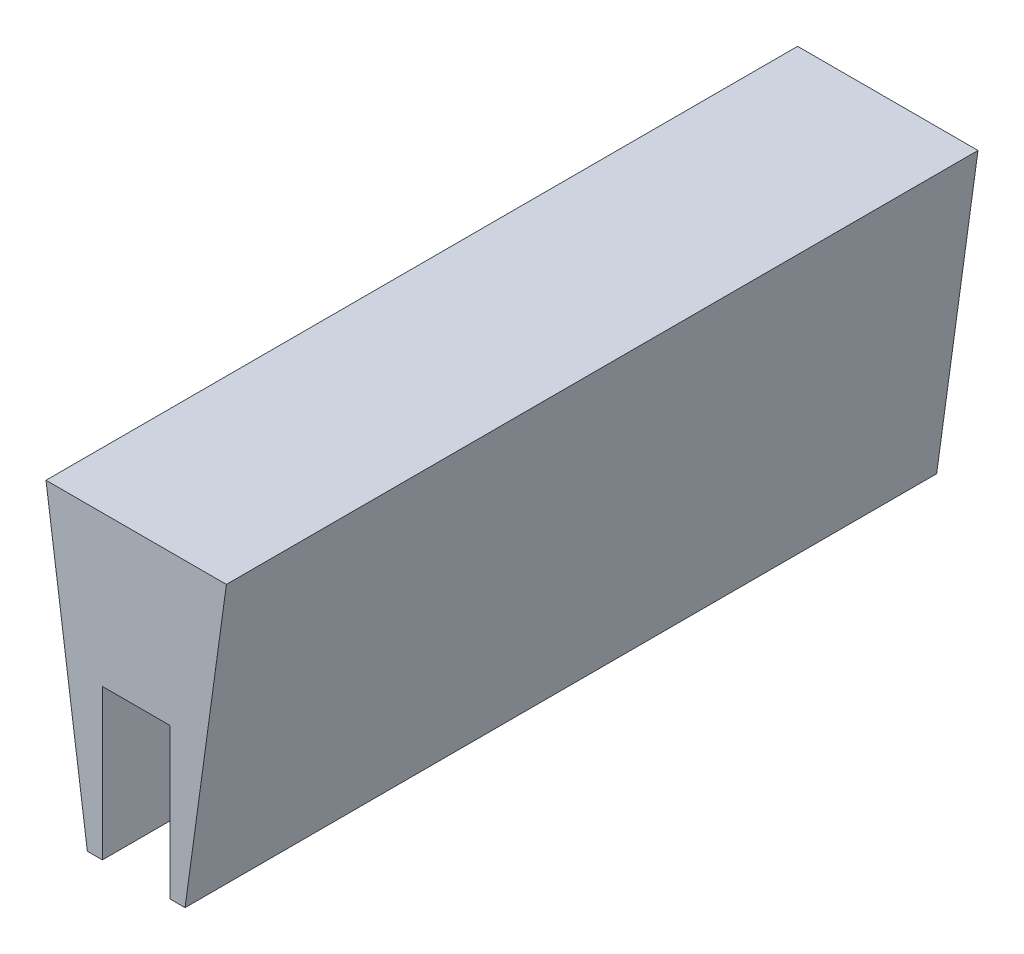
ISO-10303-21;
HEADER;
FILE_DESCRIPTION(('STEP AP214'),'2;1');
FILE_NAME('part.step','',(''),(''),'','','');
FILE_SCHEMA(('AUTOMOTIVE_DESIGN { 1 0 10303 214 1 1 1 1 }'));
ENDSEC;
DATA;
#1=APPLICATION_CONTEXT('core data for automotive mechanical design processes');
#2=APPLICATION_PROTOCOL_DEFINITION('international standard','automotive_design',2000,#1);
#3=PRODUCT_CONTEXT('',#1,'mechanical');
#4=PRODUCT('Part','Part','',(#3));
#5=PRODUCT_RELATED_PRODUCT_CATEGORY('part','',(#4));
#6=PRODUCT_DEFINITION_FORMATION('','',#4);
#7=PRODUCT_DEFINITION_CONTEXT('part definition',#1,'design');
#8=PRODUCT_DEFINITION('design','',#6,#7);
#9=PRODUCT_DEFINITION_SHAPE('','',#8);
#10=(LENGTH_UNIT() NAMED_UNIT(*) SI_UNIT(.MILLI.,.METRE.));
#11=(NAMED_UNIT(*) PLANE_ANGLE_UNIT() SI_UNIT($,.RADIAN.));
#12=(NAMED_UNIT(*) SI_UNIT($,.STERADIAN.) SOLID_ANGLE_UNIT());
#13=UNCERTAINTY_MEASURE_WITH_UNIT(LENGTH_MEASURE(1.E-05),#10,'distance_accuracy_value','');
#14=(GEOMETRIC_REPRESENTATION_CONTEXT(3) GLOBAL_UNCERTAINTY_ASSIGNED_CONTEXT((#13)) GLOBAL_UNIT_ASSIGNED_CONTEXT((#10,
#11,#12)) REPRESENTATION_CONTEXT('',''));
#15=CARTESIAN_POINT('',(0.,0.,0.));
#16=DIRECTION('',(0.,0.,1.));
#17=DIRECTION('',(1.,0.,0.));
#18=AXIS2_PLACEMENT_3D('',#15,#16,#17);
#19=CARTESIAN_POINT('',(6.,20.,50.));
#20=DIRECTION('',(-0.990678839845296,0.136218340478728,0.));
#21=DIRECTION('',(-0.136218340478728,-0.990678839845296,0.));
#22=AXIS2_PLACEMENT_3D('',#19,#20,#21);
#23=PLANE('',#22);
#24=DIRECTION('',(0.136218340478728,0.990678839845296,0.));
#25=VECTOR('',#24,1.);
#26=CARTESIAN_POINT('',(6.,20.,0.));
#27=LINE('',#26,#25);
#28=CARTESIAN_POINT('',(3.25,0.,0.));
#29=VERTEX_POINT('',#28);
#30=CARTESIAN_POINT('',(6.,20.,0.));
#31=VERTEX_POINT('',#30);
#32=EDGE_CURVE('E140',#29,#31,#27,.T.);
#33=ORIENTED_EDGE('',*,*,#32,.T.);
#34=DIRECTION('',(0.,0.,-1.));
#35=VECTOR('',#34,1.);
#36=CARTESIAN_POINT('',(6.,20.,50.));
#37=LINE('',#36,#35);
#38=CARTESIAN_POINT('',(6.,20.,50.));
#39=VERTEX_POINT('',#38);
#40=EDGE_CURVE('E11',#39,#31,#37,.T.);
#41=ORIENTED_EDGE('',*,*,#40,.F.);
#42=DIRECTION('',(0.136218340478728,0.990678839845296,0.));
#43=VECTOR('',#42,1.);
#44=CARTESIAN_POINT('',(6.,20.,50.));
#45=LINE('',#44,#43);
#46=CARTESIAN_POINT('',(3.25,0.,50.));
#47=VERTEX_POINT('',#46);
#48=EDGE_CURVE('E162',#47,#39,#45,.T.);
#49=ORIENTED_EDGE('',*,*,#48,.F.);
#50=DIRECTION('',(0.,0.,-1.));
#51=VECTOR('',#50,1.);
#52=CARTESIAN_POINT('',(3.25,0.,50.));
#53=LINE('',#52,#51);
#54=EDGE_CURVE('E136',#47,#29,#53,.T.);
#55=ORIENTED_EDGE('',*,*,#54,.T.);
#56=EDGE_LOOP('',(#33,#41,#49,#55));
#57=FACE_BOUND('',#56,.T.);
#58=ADVANCED_FACE('F39',(#57),#23,.F.);
#59=CARTESIAN_POINT('',(-6.,20.,50.));
#60=DIRECTION('',(0.,-1.,0.));
#61=DIRECTION('',(0.,0.,-1.));
#62=AXIS2_PLACEMENT_3D('',#59,#60,#61);
#63=PLANE('',#62);
#64=DIRECTION('',(-1.,0.,0.));
#65=VECTOR('',#64,1.);
#66=CARTESIAN_POINT('',(-6.,20.,0.));
#67=LINE('',#66,#65);
#68=CARTESIAN_POINT('',(-6.,20.,0.));
#69=VERTEX_POINT('',#68);
#70=EDGE_CURVE('E144',#31,#69,#67,.T.);
#71=ORIENTED_EDGE('',*,*,#70,.T.);
#72=DIRECTION('',(0.,0.,-1.));
#73=VECTOR('',#72,1.);
#74=CARTESIAN_POINT('',(-6.,20.,50.));
#75=LINE('',#74,#73);
#76=CARTESIAN_POINT('',(-6.,20.,50.));
#77=VERTEX_POINT('',#76);
#78=EDGE_CURVE('E48',#77,#69,#75,.T.);
#79=ORIENTED_EDGE('',*,*,#78,.F.);
#80=DIRECTION('',(-1.,0.,0.));
#81=VECTOR('',#80,1.);
#82=CARTESIAN_POINT('',(-6.,20.,50.));
#83=LINE('',#82,#81);
#84=EDGE_CURVE('E99',#39,#77,#83,.T.);
#85=ORIENTED_EDGE('',*,*,#84,.F.);
#86=ORIENTED_EDGE('',*,*,#40,.T.);
#87=EDGE_LOOP('',(#71,#79,#85,#86));
#88=FACE_BOUND('',#87,.T.);
#89=ADVANCED_FACE('F208',(#88),#63,.F.);
#90=CARTESIAN_POINT('',(-6.,20.,50.));
#91=DIRECTION('',(0.990678839845296,0.136218340478728,0.));
#92=DIRECTION('',(-0.136218340478728,0.990678839845296,0.));
#93=AXIS2_PLACEMENT_3D('',#90,#91,#92);
#94=PLANE('',#93);
#95=DIRECTION('',(0.136218340478728,-0.990678839845296,0.));
#96=VECTOR('',#95,1.);
#97=CARTESIAN_POINT('',(-6.,20.,0.));
#98=LINE('',#97,#96);
#99=CARTESIAN_POINT('',(-3.25,0.,0.));
#100=VERTEX_POINT('',#99);
#101=EDGE_CURVE('E147',#69,#100,#98,.T.);
#102=ORIENTED_EDGE('',*,*,#101,.T.);
#103=DIRECTION('',(0.,0.,-1.));
#104=VECTOR('',#103,1.);
#105=CARTESIAN_POINT('',(-3.25,0.,50.));
#106=LINE('',#105,#104);
#107=CARTESIAN_POINT('',(-3.25,0.,50.));
#108=VERTEX_POINT('',#107);
#109=EDGE_CURVE('E173',#108,#100,#106,.T.);
#110=ORIENTED_EDGE('',*,*,#109,.F.);
#111=DIRECTION('',(0.136218340478728,-0.990678839845296,0.));
#112=VECTOR('',#111,1.);
#113=CARTESIAN_POINT('',(-6.,20.,50.));
#114=LINE('',#113,#112);
#115=EDGE_CURVE('E183',#77,#108,#114,.T.);
#116=ORIENTED_EDGE('',*,*,#115,.F.);
#117=ORIENTED_EDGE('',*,*,#78,.T.);
#118=EDGE_LOOP('',(#102,#110,#116,#117));
#119=FACE_BOUND('',#118,.T.);
#120=ADVANCED_FACE('F181',(#119),#94,.F.);
#121=CARTESIAN_POINT('',(-3.25,0.,50.));
#122=DIRECTION('',(0.,1.,0.));
#123=DIRECTION('',(-1.,0.,0.));
#124=AXIS2_PLACEMENT_3D('',#121,#122,#123);
#125=PLANE('',#124);
#126=DIRECTION('',(1.,0.,0.));
#127=VECTOR('',#126,1.);
#128=CARTESIAN_POINT('',(-3.25,0.,0.));
#129=LINE('',#128,#127);
#130=CARTESIAN_POINT('',(-2.25,0.,0.));
#131=VERTEX_POINT('',#130);
#132=EDGE_CURVE('E150',#100,#131,#129,.T.);
#133=ORIENTED_EDGE('',*,*,#132,.T.);
#134=DIRECTION('',(0.,0.,-1.));
#135=VECTOR('',#134,1.);
#136=CARTESIAN_POINT('',(-2.25,0.,50.));
#137=LINE('',#136,#135);
#138=CARTESIAN_POINT('',(-2.25,0.,50.));
#139=VERTEX_POINT('',#138);
#140=EDGE_CURVE('E169',#139,#131,#137,.T.);
#141=ORIENTED_EDGE('',*,*,#140,.F.);
#142=DIRECTION('',(1.,0.,0.));
#143=VECTOR('',#142,1.);
#144=CARTESIAN_POINT('',(-3.25,0.,50.));
#145=LINE('',#144,#143);
#146=EDGE_CURVE('E196',#108,#139,#145,.T.);
#147=ORIENTED_EDGE('',*,*,#146,.F.);
#148=ORIENTED_EDGE('',*,*,#109,.T.);
#149=EDGE_LOOP('',(#133,#141,#147,#148));
#150=FACE_BOUND('',#149,.T.);
#151=ADVANCED_FACE('F191',(#150),#125,.F.);
#152=CARTESIAN_POINT('',(-2.25,0.,50.));
#153=DIRECTION('',(-1.,0.,0.));
#154=DIRECTION('',(0.,0.,1.));
#155=AXIS2_PLACEMENT_3D('',#152,#153,#154);
#156=PLANE('',#155);
#157=DIRECTION('',(0.,1.,0.));
#158=VECTOR('',#157,1.);
#159=CARTESIAN_POINT('',(-2.25,0.,0.));
#160=LINE('',#159,#158);
#161=CARTESIAN_POINT('',(-2.25,10.,0.));
#162=VERTEX_POINT('',#161);
#163=EDGE_CURVE('E153',#131,#162,#160,.T.);
#164=ORIENTED_EDGE('',*,*,#163,.T.);
#165=DIRECTION('',(0.,0.,-1.));
#166=VECTOR('',#165,1.);
#167=CARTESIAN_POINT('',(-2.25,10.,50.));
#168=LINE('',#167,#166);
#169=CARTESIAN_POINT('',(-2.25,10.,50.));
#170=VERTEX_POINT('',#169);
#171=EDGE_CURVE('E129',#170,#162,#168,.T.);
#172=ORIENTED_EDGE('',*,*,#171,.F.);
#173=DIRECTION('',(0.,1.,0.));
#174=VECTOR('',#173,1.);
#175=CARTESIAN_POINT('',(-2.25,0.,50.));
#176=LINE('',#175,#174);
#177=EDGE_CURVE('E118',#139,#170,#176,.T.);
#178=ORIENTED_EDGE('',*,*,#177,.F.);
#179=ORIENTED_EDGE('',*,*,#140,.T.);
#180=EDGE_LOOP('',(#164,#172,#178,#179));
#181=FACE_BOUND('',#180,.T.);
#182=ADVANCED_FACE('F194',(#181),#156,.F.);
#183=CARTESIAN_POINT('',(2.25,10.,50.));
#184=DIRECTION('',(0.,1.,0.));
#185=DIRECTION('',(0.,0.,1.));
#186=AXIS2_PLACEMENT_3D('',#183,#184,#185);
#187=PLANE('',#186);
#188=DIRECTION('',(1.,0.,0.));
#189=VECTOR('',#188,1.);
#190=CARTESIAN_POINT('',(2.25,10.,0.));
#191=LINE('',#190,#189);
#192=CARTESIAN_POINT('',(2.25,10.,0.));
#193=VERTEX_POINT('',#192);
#194=EDGE_CURVE('E127',#162,#193,#191,.T.);
#195=ORIENTED_EDGE('',*,*,#194,.T.);
#196=DIRECTION('',(0.,0.,-1.));
#197=VECTOR('',#196,1.);
#198=CARTESIAN_POINT('',(2.25,10.,50.));
#199=LINE('',#198,#197);
#200=CARTESIAN_POINT('',(2.25,10.,50.));
#201=VERTEX_POINT('',#200);
#202=EDGE_CURVE('E124',#201,#193,#199,.T.);
#203=ORIENTED_EDGE('',*,*,#202,.F.);
#204=DIRECTION('',(1.,0.,0.));
#205=VECTOR('',#204,1.);
#206=CARTESIAN_POINT('',(2.25,10.,50.));
#207=LINE('',#206,#205);
#208=EDGE_CURVE('E112',#170,#201,#207,.T.);
#209=ORIENTED_EDGE('',*,*,#208,.F.);
#210=ORIENTED_EDGE('',*,*,#171,.T.);
#211=EDGE_LOOP('',(#195,#203,#209,#210));
#212=FACE_BOUND('',#211,.T.);
#213=ADVANCED_FACE('F125',(#212),#187,.F.);
#214=CARTESIAN_POINT('',(2.25,0.,50.));
#215=DIRECTION('',(1.,0.,0.));
#216=DIRECTION('',(0.,0.,-1.));
#217=AXIS2_PLACEMENT_3D('',#214,#215,#216);
#218=PLANE('',#217);
#219=DIRECTION('',(0.,-1.,0.));
#220=VECTOR('',#219,1.);
#221=CARTESIAN_POINT('',(2.25,0.,0.));
#222=LINE('',#221,#220);
#223=CARTESIAN_POINT('',(2.25,0.,0.));
#224=VERTEX_POINT('',#223);
#225=EDGE_CURVE('E85',#193,#224,#222,.T.);
#226=ORIENTED_EDGE('',*,*,#225,.T.);
#227=DIRECTION('',(0.,0.,-1.));
#228=VECTOR('',#227,1.);
#229=CARTESIAN_POINT('',(2.25,0.,50.));
#230=LINE('',#229,#228);
#231=CARTESIAN_POINT('',(2.25,0.,50.));
#232=VERTEX_POINT('',#231);
#233=EDGE_CURVE('E130',#232,#224,#230,.T.);
#234=ORIENTED_EDGE('',*,*,#233,.F.);
#235=DIRECTION('',(0.,-1.,0.));
#236=VECTOR('',#235,1.);
#237=CARTESIAN_POINT('',(2.25,0.,50.));
#238=LINE('',#237,#236);
#239=EDGE_CURVE('E116',#201,#232,#238,.T.);
#240=ORIENTED_EDGE('',*,*,#239,.F.);
#241=ORIENTED_EDGE('',*,*,#202,.T.);
#242=EDGE_LOOP('',(#226,#234,#240,#241));
#243=FACE_BOUND('',#242,.T.);
#244=ADVANCED_FACE('F132',(#243),#218,.F.);
#245=CARTESIAN_POINT('',(3.25,0.,50.));
#246=DIRECTION('',(0.,1.,0.));
#247=DIRECTION('',(-1.,0.,0.));
#248=AXIS2_PLACEMENT_3D('',#245,#246,#247);
#249=PLANE('',#248);
#250=DIRECTION('',(1.,0.,0.));
#251=VECTOR('',#250,1.);
#252=CARTESIAN_POINT('',(3.25,0.,0.));
#253=LINE('',#252,#251);
#254=EDGE_CURVE('E91',#224,#29,#253,.T.);
#255=ORIENTED_EDGE('',*,*,#254,.T.);
#256=ORIENTED_EDGE('',*,*,#54,.F.);
#257=DIRECTION('',(1.,0.,0.));
#258=VECTOR('',#257,1.);
#259=CARTESIAN_POINT('',(3.25,0.,50.));
#260=LINE('',#259,#258);
#261=EDGE_CURVE('E56',#232,#47,#260,.T.);
#262=ORIENTED_EDGE('',*,*,#261,.F.);
#263=ORIENTED_EDGE('',*,*,#233,.T.);
#264=EDGE_LOOP('',(#255,#256,#262,#263));
#265=FACE_BOUND('',#264,.T.);
#266=ADVANCED_FACE('F224',(#265),#249,.F.);
#267=CARTESIAN_POINT('',(0.,0.,50.));
#268=DIRECTION('',(0.,0.,-1.));
#269=DIRECTION('',(-1.,0.,0.));
#270=AXIS2_PLACEMENT_3D('',#267,#268,#269);
#271=PLANE('',#270);
#272=ORIENTED_EDGE('',*,*,#48,.T.);
#273=ORIENTED_EDGE('',*,*,#84,.T.);
#274=ORIENTED_EDGE('',*,*,#115,.T.);
#275=ORIENTED_EDGE('',*,*,#146,.T.);
#276=ORIENTED_EDGE('',*,*,#177,.T.);
#277=ORIENTED_EDGE('',*,*,#208,.T.);
#278=ORIENTED_EDGE('',*,*,#239,.T.);
#279=ORIENTED_EDGE('',*,*,#261,.T.);
#280=EDGE_LOOP('',(#272,#273,#274,#275,#276,#277,#278,#279));
#281=FACE_BOUND('',#280,.T.);
#282=ADVANCED_FACE('F114',(#281),#271,.F.);
#283=CARTESIAN_POINT('',(0.,0.,0.));
#284=DIRECTION('',(0.,0.,-1.));
#285=DIRECTION('',(-1.,0.,0.));
#286=AXIS2_PLACEMENT_3D('',#283,#284,#285);
#287=PLANE('',#286);
#288=ORIENTED_EDGE('',*,*,#32,.F.);
#289=ORIENTED_EDGE('',*,*,#254,.F.);
#290=ORIENTED_EDGE('',*,*,#225,.F.);
#291=ORIENTED_EDGE('',*,*,#194,.F.);
#292=ORIENTED_EDGE('',*,*,#163,.F.);
#293=ORIENTED_EDGE('',*,*,#132,.F.);
#294=ORIENTED_EDGE('',*,*,#101,.F.);
#295=ORIENTED_EDGE('',*,*,#70,.F.);
#296=EDGE_LOOP('',(#288,#289,#290,#291,#292,#293,#294,#295));
#297=FACE_BOUND('',#296,.T.);
#298=ADVANCED_FACE('F187',(#297),#287,.T.);
#299=CLOSED_SHELL('',(#58,#89,#120,#151,#182,#213,#244,#266,#282,#298));
#300=MANIFOLD_SOLID_BREP('B2',#299);
#301=ADVANCED_BREP_SHAPE_REPRESENTATION('',(#18,#300),#14);
#302=SHAPE_DEFINITION_REPRESENTATION(#9,#301);
ENDSEC;
END-ISO-10303-21;
